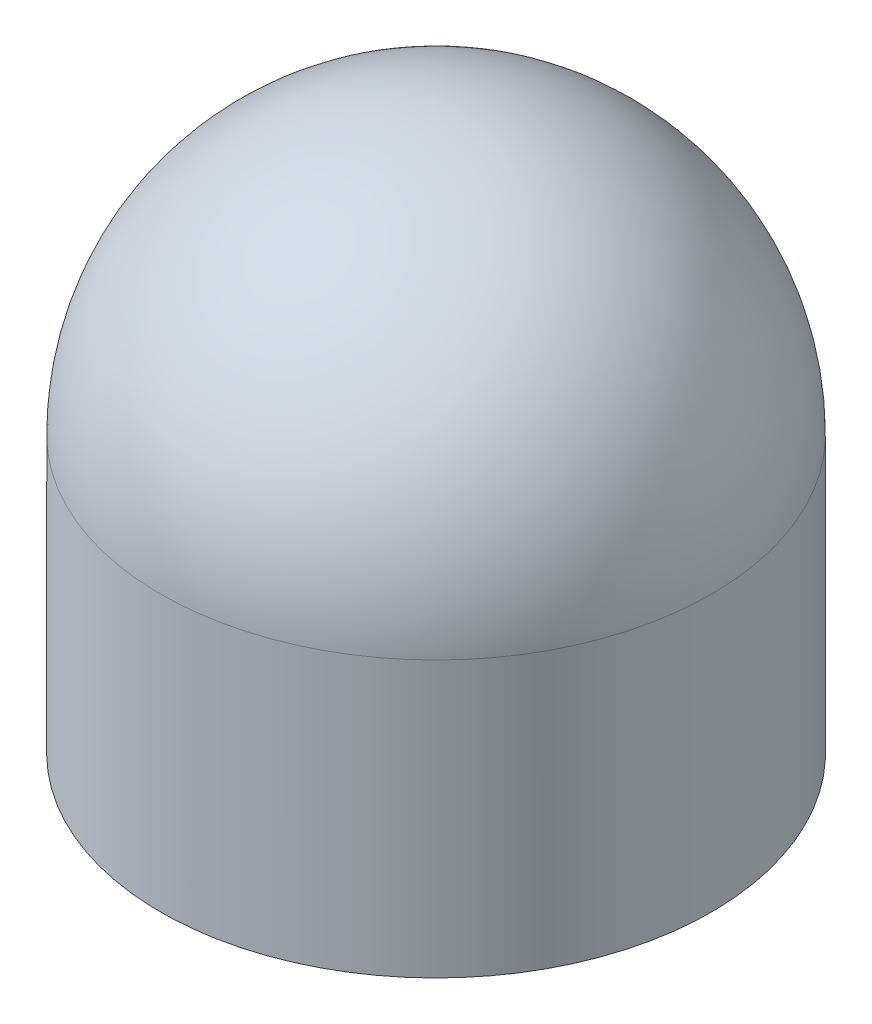
ISO-10303-21;
HEADER;
FILE_DESCRIPTION(('STEP AP214'),'2;1');
FILE_NAME('part.step','',(''),(''),'','','');
FILE_SCHEMA(('AUTOMOTIVE_DESIGN { 1 0 10303 214 1 1 1 1 }'));
ENDSEC;
DATA;
#1=APPLICATION_CONTEXT('core data for automotive mechanical design processes');
#2=APPLICATION_PROTOCOL_DEFINITION('international standard','automotive_design',2000,#1);
#3=PRODUCT_CONTEXT('',#1,'mechanical');
#4=PRODUCT('Part','Part','',(#3));
#5=PRODUCT_RELATED_PRODUCT_CATEGORY('part','',(#4));
#6=PRODUCT_DEFINITION_FORMATION('','',#4);
#7=PRODUCT_DEFINITION_CONTEXT('part definition',#1,'design');
#8=PRODUCT_DEFINITION('design','',#6,#7);
#9=PRODUCT_DEFINITION_SHAPE('','',#8);
#10=(LENGTH_UNIT() NAMED_UNIT(*) SI_UNIT(.MILLI.,.METRE.));
#11=(NAMED_UNIT(*) PLANE_ANGLE_UNIT() SI_UNIT($,.RADIAN.));
#12=(NAMED_UNIT(*) SI_UNIT($,.STERADIAN.) SOLID_ANGLE_UNIT());
#13=UNCERTAINTY_MEASURE_WITH_UNIT(LENGTH_MEASURE(1.E-05),#10,'distance_accuracy_value','');
#14=(GEOMETRIC_REPRESENTATION_CONTEXT(3) GLOBAL_UNCERTAINTY_ASSIGNED_CONTEXT((#13)) GLOBAL_UNIT_ASSIGNED_CONTEXT((#10,
#11,#12)) REPRESENTATION_CONTEXT('',''));
#15=CARTESIAN_POINT('',(0.,0.,0.));
#16=DIRECTION('',(0.,0.,1.));
#17=DIRECTION('',(1.,0.,0.));
#18=AXIS2_PLACEMENT_3D('',#15,#16,#17);
#19=CARTESIAN_POINT('',(0.,0.,0.));
#20=DIRECTION('',(0.,1.,0.));
#21=DIRECTION('',(0.,0.,1.));
#22=AXIS2_PLACEMENT_3D('',#19,#20,#21);
#23=PLANE('',#22);
#24=CARTESIAN_POINT('',(0.,0.,0.));
#25=DIRECTION('',(0.,-1.,0.));
#26=DIRECTION('',(0.,0.,-1.));
#27=AXIS2_PLACEMENT_3D('',#24,#25,#26);
#28=CIRCLE('',#27,6.35);
#29=CARTESIAN_POINT('',(0.,0.,-6.35));
#30=VERTEX_POINT('',#29);
#31=EDGE_CURVE('E10',#30,#30,#28,.T.);
#32=ORIENTED_EDGE('',*,*,#31,.T.);
#33=EDGE_LOOP('',(#32));
#34=FACE_BOUND('',#33,.T.);
#35=ADVANCED_FACE('F28',(#34),#23,.F.);
#36=CARTESIAN_POINT('',(0.,0.,0.));
#37=DIRECTION('',(0.,-1.,0.));
#38=DIRECTION('',(0.,0.,-1.));
#39=AXIS2_PLACEMENT_3D('',#36,#37,#38);
#40=CYLINDRICAL_SURFACE('',#39,6.35);
#41=ORIENTED_EDGE('',*,*,#31,.F.);
#42=EDGE_LOOP('',(#41));
#43=FACE_BOUND('',#42,.T.);
#44=CARTESIAN_POINT('',(0.,6.35,0.));
#45=DIRECTION('',(0.,-1.,0.));
#46=DIRECTION('',(0.,0.,-1.));
#47=AXIS2_PLACEMENT_3D('',#44,#45,#46);
#48=CIRCLE('',#47,6.35);
#49=CARTESIAN_POINT('',(0.,6.35,-6.35));
#50=VERTEX_POINT('',#49);
#51=EDGE_CURVE('E34',#50,#50,#48,.T.);
#52=ORIENTED_EDGE('',*,*,#51,.T.);
#53=EDGE_LOOP('',(#52));
#54=FACE_BOUND('',#53,.T.);
#55=ADVANCED_FACE('F40',(#43,#54),#40,.T.);
#56=CARTESIAN_POINT('',(0.,6.35,0.));
#57=DIRECTION('',(0.,-1.,0.));
#58=DIRECTION('',(-1.,0.,0.));
#59=AXIS2_PLACEMENT_3D('',#56,#57,#58);
#60=SPHERICAL_SURFACE('',#59,6.35);
#61=ORIENTED_EDGE('',*,*,#51,.F.);
#62=EDGE_LOOP('',(#61));
#63=FACE_BOUND('',#62,.T.);
#64=ADVANCED_FACE('F42',(#63),#60,.T.);
#65=CLOSED_SHELL('',(#35,#55,#64));
#66=MANIFOLD_SOLID_BREP('B2',#65);
#67=ADVANCED_BREP_SHAPE_REPRESENTATION('',(#18,#66),#14);
#68=SHAPE_DEFINITION_REPRESENTATION(#9,#67);
ENDSEC;
END-ISO-10303-21;
